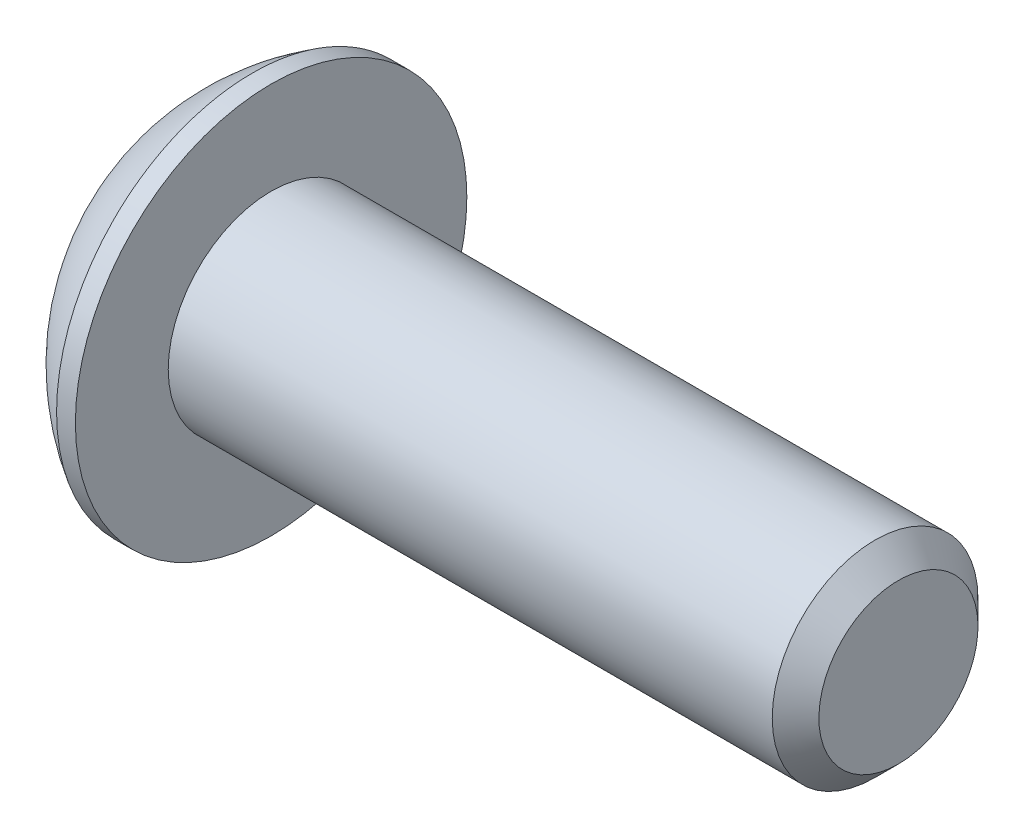
ISO-10303-21;
HEADER;
FILE_DESCRIPTION(('STEP AP214'),'2;1');
FILE_NAME('part.step','',(''),(''),'','','');
FILE_SCHEMA(('AUTOMOTIVE_DESIGN { 1 0 10303 214 1 1 1 1 }'));
ENDSEC;
DATA;
#1=APPLICATION_CONTEXT('core data for automotive mechanical design processes');
#2=APPLICATION_PROTOCOL_DEFINITION('international standard','automotive_design',2000,#1);
#3=PRODUCT_CONTEXT('',#1,'mechanical');
#4=PRODUCT('Part','Part','',(#3));
#5=PRODUCT_RELATED_PRODUCT_CATEGORY('part','',(#4));
#6=PRODUCT_DEFINITION_FORMATION('','',#4);
#7=PRODUCT_DEFINITION_CONTEXT('part definition',#1,'design');
#8=PRODUCT_DEFINITION('design','',#6,#7);
#9=PRODUCT_DEFINITION_SHAPE('','',#8);
#10=(LENGTH_UNIT() NAMED_UNIT(*) SI_UNIT(.MILLI.,.METRE.));
#11=(NAMED_UNIT(*) PLANE_ANGLE_UNIT() SI_UNIT($,.RADIAN.));
#12=(NAMED_UNIT(*) SI_UNIT($,.STERADIAN.) SOLID_ANGLE_UNIT());
#13=UNCERTAINTY_MEASURE_WITH_UNIT(LENGTH_MEASURE(1.E-05),#10,'distance_accuracy_value','');
#14=(GEOMETRIC_REPRESENTATION_CONTEXT(3) GLOBAL_UNCERTAINTY_ASSIGNED_CONTEXT((#13)) GLOBAL_UNIT_ASSIGNED_CONTEXT((#10,
#11,#12)) REPRESENTATION_CONTEXT('',''));
#15=CARTESIAN_POINT('',(0.,0.,0.));
#16=DIRECTION('',(0.,0.,1.));
#17=DIRECTION('',(1.,0.,0.));
#18=AXIS2_PLACEMENT_3D('',#15,#16,#17);
#19=CARTESIAN_POINT('',(1.32080000000034,0.,0.));
#20=DIRECTION('',(-1.,0.,0.));
#21=DIRECTION('',(0.,-1.,0.));
#22=AXIS2_PLACEMENT_3D('',#19,#20,#21);
#23=CONICAL_SURFACE('',#22,1.1937999999998,1.04719755119608);
#24=CARTESIAN_POINT('',(2.01004075135902,0.,4.44089209850063E-13));
#25=VERTEX_POINT('',#24);
#26=VERTEX_LOOP('',#25);
#27=FACE_BOUND('',#26,.T.);
#28=CARTESIAN_POINT('',(1.32080000000022,0.,0.));
#29=DIRECTION('',(-1.,0.,0.));
#30=DIRECTION('',(0.,-1.,0.));
#31=AXIS2_PLACEMENT_3D('',#28,#29,#30);
#32=CIRCLE('',#31,1.19380000000002);
#33=CARTESIAN_POINT('',(1.32080000000015,-1.03386112703791,0.596900000000036));
#34=VERTEX_POINT('',#33);
#35=CARTESIAN_POINT('',(1.32080000000015,0.,1.19380000000011));
#36=VERTEX_POINT('',#35);
#37=EDGE_CURVE('E21',#34,#36,#32,.T.);
#38=ORIENTED_EDGE('',*,*,#37,.T.);
#39=CARTESIAN_POINT('',(1.32080000000009,0.,0.));
#40=DIRECTION('',(-1.,0.,0.));
#41=DIRECTION('',(0.,-1.,0.));
#42=AXIS2_PLACEMENT_3D('',#39,#40,#41);
#43=CIRCLE('',#42,1.19380000000024);
#44=CARTESIAN_POINT('',(1.32080000000004,1.03386112703797,0.596900000000073));
#45=VERTEX_POINT('',#44);
#46=EDGE_CURVE('E149',#36,#45,#43,.T.);
#47=ORIENTED_EDGE('',*,*,#46,.T.);
#48=CARTESIAN_POINT('',(1.32080000000009,0.,0.));
#49=DIRECTION('',(-1.,0.,0.));
#50=DIRECTION('',(0.,-1.,0.));
#51=AXIS2_PLACEMENT_3D('',#48,#49,#50);
#52=CIRCLE('',#51,1.19380000000024);
#53=CARTESIAN_POINT('',(1.32080000000009,1.03386112703793,-0.596900000000125));
#54=VERTEX_POINT('',#53);
#55=EDGE_CURVE('E406',#45,#54,#52,.T.);
#56=ORIENTED_EDGE('',*,*,#55,.T.);
#57=CARTESIAN_POINT('',(1.32080000000009,0.,0.));
#58=DIRECTION('',(-1.,0.,0.));
#59=DIRECTION('',(0.,-1.,0.));
#60=AXIS2_PLACEMENT_3D('',#57,#58,#59);
#61=CIRCLE('',#60,1.19380000000024);
#62=CARTESIAN_POINT('',(1.32080000000006,0.,-1.19380000000015));
#63=VERTEX_POINT('',#62);
#64=EDGE_CURVE('E407',#54,#63,#61,.T.);
#65=ORIENTED_EDGE('',*,*,#64,.T.);
#66=CARTESIAN_POINT('',(1.32080000000009,0.,0.));
#67=DIRECTION('',(-1.,0.,0.));
#68=DIRECTION('',(0.,-1.,0.));
#69=AXIS2_PLACEMENT_3D('',#66,#67,#68);
#70=CIRCLE('',#69,1.19380000000024);
#71=CARTESIAN_POINT('',(1.32080000000009,-1.03386112703797,-0.596900000000177));
#72=VERTEX_POINT('',#71);
#73=EDGE_CURVE('E94',#63,#72,#70,.T.);
#74=ORIENTED_EDGE('',*,*,#73,.T.);
#75=CARTESIAN_POINT('',(1.32080000000009,0.,0.));
#76=DIRECTION('',(-1.,0.,0.));
#77=DIRECTION('',(0.,-1.,0.));
#78=AXIS2_PLACEMENT_3D('',#75,#76,#77);
#79=CIRCLE('',#78,1.19380000000024);
#80=EDGE_CURVE('E90',#72,#34,#79,.T.);
#81=ORIENTED_EDGE('',*,*,#80,.T.);
#82=EDGE_LOOP('',(#38,#47,#56,#65,#74,#81));
#83=FACE_BOUND('',#82,.T.);
#84=ADVANCED_FACE('F18',(#27,#83),#23,.F.);
#85=CARTESIAN_POINT('',(1.3208,-1.37848150271714,-2.22044604925031E-13));
#86=DIRECTION('',(1.,0.,0.));
#87=DIRECTION('',(0.,1.,0.));
#88=AXIS2_PLACEMENT_3D('',#85,#86,#87);
#89=PLANE('',#88);
#90=DIRECTION('',(0.,0.500000000000001,0.866025403784438));
#91=VECTOR('',#90,1.);
#92=CARTESIAN_POINT('',(1.3208,-1.37848150271714,-2.22044604925031E-13));
#93=LINE('',#92,#91);
#94=CARTESIAN_POINT('',(1.3208,-0.689240751358501,1.19379999999993));
#95=VERTEX_POINT('',#94);
#96=EDGE_CURVE('E102',#95,#34,#93,.F.);
#97=ORIENTED_EDGE('',*,*,#96,.F.);
#98=DIRECTION('',(0.,1.,0.));
#99=VECTOR('',#98,1.);
#100=CARTESIAN_POINT('',(1.3208,-0.68924075135858,1.19379999999997));
#101=LINE('',#100,#99);
#102=EDGE_CURVE('E104',#36,#95,#101,.F.);
#103=ORIENTED_EDGE('',*,*,#102,.F.);
#104=ORIENTED_EDGE('',*,*,#37,.F.);
#105=EDGE_LOOP('',(#97,#103,#104));
#106=FACE_BOUND('',#105,.T.);
#107=ADVANCED_FACE('F100',(#106),#89,.F.);
#108=CARTESIAN_POINT('',(1.3208,-1.37848150271714,-2.22044604925031E-13));
#109=DIRECTION('',(1.,0.,0.));
#110=DIRECTION('',(0.,1.,0.));
#111=AXIS2_PLACEMENT_3D('',#108,#109,#110);
#112=PLANE('',#111);
#113=DIRECTION('',(0.,-0.5,0.866025403784438));
#114=VECTOR('',#113,1.);
#115=CARTESIAN_POINT('',(1.3208,-0.68924075135858,-1.19380000000024));
#116=LINE('',#115,#114);
#117=CARTESIAN_POINT('',(1.3208,-1.37848150271716,-2.33780927942087E-13));
#118=VERTEX_POINT('',#117);
#119=EDGE_CURVE('E110',#118,#72,#116,.F.);
#120=ORIENTED_EDGE('',*,*,#119,.F.);
#121=DIRECTION('',(0.,0.500000000000001,0.866025403784438));
#122=VECTOR('',#121,1.);
#123=CARTESIAN_POINT('',(1.3208,-1.37848150271714,-2.22044604925031E-13));
#124=LINE('',#123,#122);
#125=EDGE_CURVE('E107',#34,#118,#124,.F.);
#126=ORIENTED_EDGE('',*,*,#125,.F.);
#127=ORIENTED_EDGE('',*,*,#80,.F.);
#128=EDGE_LOOP('',(#120,#126,#127));
#129=FACE_BOUND('',#128,.T.);
#130=ADVANCED_FACE('F108',(#129),#112,.F.);
#131=CARTESIAN_POINT('',(1.3208,-1.37848150271714,-2.22044604925031E-13));
#132=DIRECTION('',(1.,0.,0.));
#133=DIRECTION('',(0.,1.,0.));
#134=AXIS2_PLACEMENT_3D('',#131,#132,#133);
#135=PLANE('',#134);
#136=DIRECTION('',(0.,1.,0.));
#137=VECTOR('',#136,1.);
#138=CARTESIAN_POINT('',(1.3208,0.689240751358559,-1.19380000000019));
#139=LINE('',#138,#137);
#140=CARTESIAN_POINT('',(1.3208,-0.689240751358584,-1.1938000000002));
#141=VERTEX_POINT('',#140);
#142=EDGE_CURVE('E377',#141,#63,#139,.T.);
#143=ORIENTED_EDGE('',*,*,#142,.F.);
#144=DIRECTION('',(0.,-0.5,0.866025403784438));
#145=VECTOR('',#144,1.);
#146=CARTESIAN_POINT('',(1.3208,-0.68924075135858,-1.19380000000024));
#147=LINE('',#146,#145);
#148=EDGE_CURVE('E389',#72,#141,#147,.F.);
#149=ORIENTED_EDGE('',*,*,#148,.F.);
#150=ORIENTED_EDGE('',*,*,#73,.F.);
#151=EDGE_LOOP('',(#143,#149,#150));
#152=FACE_BOUND('',#151,.T.);
#153=ADVANCED_FACE('F192',(#152),#135,.F.);
#154=CARTESIAN_POINT('',(1.3208,-1.37848150271714,-2.22044604925031E-13));
#155=DIRECTION('',(1.,0.,0.));
#156=DIRECTION('',(0.,1.,0.));
#157=AXIS2_PLACEMENT_3D('',#154,#155,#156);
#158=PLANE('',#157);
#159=DIRECTION('',(0.,-0.5,-0.866025403784439));
#160=VECTOR('',#159,1.);
#161=CARTESIAN_POINT('',(1.3208,1.37848150271715,0.));
#162=LINE('',#161,#160);
#163=CARTESIAN_POINT('',(1.3208,0.689240751358499,-1.19380000000016));
#164=VERTEX_POINT('',#163);
#165=EDGE_CURVE('E363',#164,#54,#162,.F.);
#166=ORIENTED_EDGE('',*,*,#165,.F.);
#167=DIRECTION('',(0.,1.,0.));
#168=VECTOR('',#167,1.);
#169=CARTESIAN_POINT('',(1.3208,0.689240751358559,-1.19380000000019));
#170=LINE('',#169,#168);
#171=EDGE_CURVE('E374',#63,#164,#170,.T.);
#172=ORIENTED_EDGE('',*,*,#171,.F.);
#173=ORIENTED_EDGE('',*,*,#64,.F.);
#174=EDGE_LOOP('',(#166,#172,#173));
#175=FACE_BOUND('',#174,.T.);
#176=ADVANCED_FACE('F188',(#175),#158,.F.);
#177=CARTESIAN_POINT('',(1.3208,-1.37848150271714,-2.22044604925031E-13));
#178=DIRECTION('',(1.,0.,0.));
#179=DIRECTION('',(0.,1.,0.));
#180=AXIS2_PLACEMENT_3D('',#177,#178,#179);
#181=PLANE('',#180);
#182=DIRECTION('',(0.,0.5,-0.866025403784439));
#183=VECTOR('',#182,1.);
#184=CARTESIAN_POINT('',(1.3208,0.68924075135858,1.19380000000002));
#185=LINE('',#184,#183);
#186=CARTESIAN_POINT('',(1.3208,1.37848150271716,0.));
#187=VERTEX_POINT('',#186);
#188=EDGE_CURVE('E342',#187,#45,#185,.F.);
#189=ORIENTED_EDGE('',*,*,#188,.F.);
#190=DIRECTION('',(0.,-0.5,-0.866025403784439));
#191=VECTOR('',#190,1.);
#192=CARTESIAN_POINT('',(1.3208,1.37848150271715,0.));
#193=LINE('',#192,#191);
#194=EDGE_CURVE('E361',#54,#187,#193,.F.);
#195=ORIENTED_EDGE('',*,*,#194,.F.);
#196=ORIENTED_EDGE('',*,*,#55,.F.);
#197=EDGE_LOOP('',(#189,#195,#196));
#198=FACE_BOUND('',#197,.T.);
#199=ADVANCED_FACE('F184',(#198),#181,.F.);
#200=CARTESIAN_POINT('',(1.3208,-1.37848150271714,-2.22044604925031E-13));
#201=DIRECTION('',(1.,0.,0.));
#202=DIRECTION('',(0.,1.,0.));
#203=AXIS2_PLACEMENT_3D('',#200,#201,#202);
#204=PLANE('',#203);
#205=DIRECTION('',(0.,1.,0.));
#206=VECTOR('',#205,1.);
#207=CARTESIAN_POINT('',(1.3208,-0.68924075135858,1.19379999999997));
#208=LINE('',#207,#206);
#209=CARTESIAN_POINT('',(1.3208,0.689240751358586,1.1938));
#210=VERTEX_POINT('',#209);
#211=EDGE_CURVE('E119',#210,#36,#208,.F.);
#212=ORIENTED_EDGE('',*,*,#211,.F.);
#213=DIRECTION('',(0.,0.5,-0.866025403784439));
#214=VECTOR('',#213,1.);
#215=CARTESIAN_POINT('',(1.3208,0.68924075135858,1.19380000000002));
#216=LINE('',#215,#214);
#217=EDGE_CURVE('E345',#45,#210,#216,.F.);
#218=ORIENTED_EDGE('',*,*,#217,.F.);
#219=ORIENTED_EDGE('',*,*,#46,.F.);
#220=EDGE_LOOP('',(#212,#218,#219));
#221=FACE_BOUND('',#220,.T.);
#222=ADVANCED_FACE('F180',(#221),#204,.F.);
#223=CARTESIAN_POINT('',(1.3208,-0.68924075135858,1.19379999999997));
#224=DIRECTION('',(0.,0.,-1.));
#225=DIRECTION('',(-1.,0.,0.));
#226=AXIS2_PLACEMENT_3D('',#223,#224,#225);
#227=PLANE('',#226);
#228=DIRECTION('',(0.,-1.,0.));
#229=VECTOR('',#228,1.);
#230=CARTESIAN_POINT('',(0.,0.,1.19380000000002));
#231=LINE('',#230,#229);
#232=CARTESIAN_POINT('',(0.,0.68924075135858,1.19379999999999));
#233=VERTEX_POINT('',#232);
#234=CARTESIAN_POINT('',(0.,-0.689240751358549,1.19379999999997));
#235=VERTEX_POINT('',#234);
#236=EDGE_CURVE('E339',#233,#235,#231,.T.);
#237=ORIENTED_EDGE('',*,*,#236,.F.);
#238=DIRECTION('',(1.,0.,0.));
#239=VECTOR('',#238,1.);
#240=CARTESIAN_POINT('',(1.3208,0.68924075135858,1.19380000000002));
#241=LINE('',#240,#239);
#242=EDGE_CURVE('E351',#210,#233,#241,.F.);
#243=ORIENTED_EDGE('',*,*,#242,.F.);
#244=ORIENTED_EDGE('',*,*,#211,.T.);
#245=ORIENTED_EDGE('',*,*,#102,.T.);
#246=DIRECTION('',(1.,0.,0.));
#247=VECTOR('',#246,1.);
#248=CARTESIAN_POINT('',(1.3208,-0.689240751358485,1.19379999999991));
#249=LINE('',#248,#247);
#250=EDGE_CURVE('E113',#235,#95,#249,.T.);
#251=ORIENTED_EDGE('',*,*,#250,.F.);
#252=EDGE_LOOP('',(#237,#243,#244,#245,#251));
#253=FACE_BOUND('',#252,.T.);
#254=ADVANCED_FACE('F177',(#253),#227,.T.);
#255=CARTESIAN_POINT('',(1.3208,-1.37848150271714,-2.22044604925031E-13));
#256=DIRECTION('',(0.,0.866025403784438,-0.500000000000001));
#257=DIRECTION('',(0.,0.500000000000001,0.866025403784438));
#258=AXIS2_PLACEMENT_3D('',#255,#256,#257);
#259=PLANE('',#258);
#260=DIRECTION('',(0.,-0.499999999999932,-0.866025403784478));
#261=VECTOR('',#260,1.);
#262=CARTESIAN_POINT('',(0.,-0.68924075135858,1.19379999999997));
#263=LINE('',#262,#261);
#264=CARTESIAN_POINT('',(0.,-1.37848150271715,-2.25312539892153E-13));
#265=VERTEX_POINT('',#264);
#266=EDGE_CURVE('E336',#235,#265,#263,.T.);
#267=ORIENTED_EDGE('',*,*,#266,.F.);
#268=ORIENTED_EDGE('',*,*,#250,.T.);
#269=ORIENTED_EDGE('',*,*,#96,.T.);
#270=ORIENTED_EDGE('',*,*,#125,.T.);
#271=DIRECTION('',(1.,0.,0.));
#272=VECTOR('',#271,1.);
#273=CARTESIAN_POINT('',(1.3208,-1.37848150271716,-2.3483819056036E-13));
#274=LINE('',#273,#272);
#275=EDGE_CURVE('E386',#265,#118,#274,.T.);
#276=ORIENTED_EDGE('',*,*,#275,.F.);
#277=EDGE_LOOP('',(#267,#268,#269,#270,#276));
#278=FACE_BOUND('',#277,.T.);
#279=ADVANCED_FACE('F117',(#278),#259,.T.);
#280=CARTESIAN_POINT('',(1.3208,-0.68924075135858,-1.19380000000024));
#281=DIRECTION('',(0.,0.866025403784438,0.5));
#282=DIRECTION('',(0.,-0.5,0.866025403784438));
#283=AXIS2_PLACEMENT_3D('',#280,#281,#282);
#284=PLANE('',#283);
#285=DIRECTION('',(0.,0.499999999999984,-0.866025403784448));
#286=VECTOR('',#285,1.);
#287=CARTESIAN_POINT('',(0.,-1.37848150271714,-2.22044604925031E-13));
#288=LINE('',#287,#286);
#289=CARTESIAN_POINT('',(0.,-0.68924075135858,-1.19380000000023));
#290=VERTEX_POINT('',#289);
#291=EDGE_CURVE('E333',#265,#290,#288,.T.);
#292=ORIENTED_EDGE('',*,*,#291,.F.);
#293=ORIENTED_EDGE('',*,*,#275,.T.);
#294=ORIENTED_EDGE('',*,*,#119,.T.);
#295=ORIENTED_EDGE('',*,*,#148,.T.);
#296=DIRECTION('',(1.,0.,0.));
#297=VECTOR('',#296,1.);
#298=CARTESIAN_POINT('',(1.3208,-0.68924075135858,-1.19380000000019));
#299=LINE('',#298,#297);
#300=EDGE_CURVE('E371',#290,#141,#299,.T.);
#301=ORIENTED_EDGE('',*,*,#300,.F.);
#302=EDGE_LOOP('',(#292,#293,#294,#295,#301));
#303=FACE_BOUND('',#302,.T.);
#304=ADVANCED_FACE('F170',(#303),#284,.T.);
#305=CARTESIAN_POINT('',(1.3208,0.689240751358559,-1.19380000000019));
#306=DIRECTION('',(0.,0.,1.));
#307=DIRECTION('',(1.,0.,0.));
#308=AXIS2_PLACEMENT_3D('',#305,#306,#307);
#309=PLANE('',#308);
#310=DIRECTION('',(0.,-1.,0.));
#311=VECTOR('',#310,1.);
#312=CARTESIAN_POINT('',(0.,0.,-1.19380000000024));
#313=LINE('',#312,#311);
#314=CARTESIAN_POINT('',(0.,0.689240751358533,-1.19380000000019));
#315=VERTEX_POINT('',#314);
#316=EDGE_CURVE('E330',#290,#315,#313,.F.);
#317=ORIENTED_EDGE('',*,*,#316,.F.);
#318=ORIENTED_EDGE('',*,*,#300,.T.);
#319=ORIENTED_EDGE('',*,*,#142,.T.);
#320=ORIENTED_EDGE('',*,*,#171,.T.);
#321=DIRECTION('',(1.,0.,0.));
#322=VECTOR('',#321,1.);
#323=CARTESIAN_POINT('',(1.3208,0.689240751358487,-1.19380000000015));
#324=LINE('',#323,#322);
#325=EDGE_CURVE('E346',#315,#164,#324,.T.);
#326=ORIENTED_EDGE('',*,*,#325,.F.);
#327=EDGE_LOOP('',(#317,#318,#319,#320,#326));
#328=FACE_BOUND('',#327,.T.);
#329=ADVANCED_FACE('F167',(#328),#309,.T.);
#330=CARTESIAN_POINT('',(1.3208,1.37848150271715,0.));
#331=DIRECTION('',(0.,-0.866025403784439,0.5));
#332=DIRECTION('',(0.,-0.5,-0.866025403784439));
#333=AXIS2_PLACEMENT_3D('',#330,#331,#332);
#334=PLANE('',#333);
#335=DIRECTION('',(0.,0.499999999999947,0.866025403784469));
#336=VECTOR('',#335,1.);
#337=CARTESIAN_POINT('',(0.,0.689240751358559,-1.19380000000019));
#338=LINE('',#337,#336);
#339=CARTESIAN_POINT('',(0.,1.37848150271715,0.));
#340=VERTEX_POINT('',#339);
#341=EDGE_CURVE('E327',#315,#340,#338,.T.);
#342=ORIENTED_EDGE('',*,*,#341,.F.);
#343=ORIENTED_EDGE('',*,*,#325,.T.);
#344=ORIENTED_EDGE('',*,*,#165,.T.);
#345=ORIENTED_EDGE('',*,*,#194,.T.);
#346=DIRECTION('',(1.,0.,0.));
#347=VECTOR('',#346,1.);
#348=CARTESIAN_POINT('',(1.3208,1.37848150271716,0.));
#349=LINE('',#348,#347);
#350=EDGE_CURVE('E36',#340,#187,#349,.T.);
#351=ORIENTED_EDGE('',*,*,#350,.F.);
#352=EDGE_LOOP('',(#342,#343,#344,#345,#351));
#353=FACE_BOUND('',#352,.T.);
#354=ADVANCED_FACE('F163',(#353),#334,.T.);
#355=CARTESIAN_POINT('',(1.3208,0.68924075135858,1.19380000000002));
#356=DIRECTION('',(0.,-0.866025403784439,-0.5));
#357=DIRECTION('',(0.,0.5,-0.866025403784439));
#358=AXIS2_PLACEMENT_3D('',#355,#356,#357);
#359=PLANE('',#358);
#360=DIRECTION('',(0.,-0.499999999999988,0.866025403784446));
#361=VECTOR('',#360,1.);
#362=CARTESIAN_POINT('',(0.,1.37848150271715,0.));
#363=LINE('',#362,#361);
#364=EDGE_CURVE('E148',#340,#233,#363,.T.);
#365=ORIENTED_EDGE('',*,*,#364,.F.);
#366=ORIENTED_EDGE('',*,*,#350,.T.);
#367=ORIENTED_EDGE('',*,*,#188,.T.);
#368=ORIENTED_EDGE('',*,*,#217,.T.);
#369=ORIENTED_EDGE('',*,*,#242,.T.);
#370=EDGE_LOOP('',(#365,#366,#367,#368,#369));
#371=FACE_BOUND('',#370,.T.);
#372=ADVANCED_FACE('F159',(#371),#359,.T.);
#373=CARTESIAN_POINT('',(0.,0.,0.));
#374=DIRECTION('',(-1.,0.,0.));
#375=DIRECTION('',(0.,-1.,0.));
#376=AXIS2_PLACEMENT_3D('',#373,#374,#375);
#377=PLANE('',#376);
#378=ORIENTED_EDGE('',*,*,#341,.T.);
#379=ORIENTED_EDGE('',*,*,#364,.T.);
#380=ORIENTED_EDGE('',*,*,#236,.T.);
#381=ORIENTED_EDGE('',*,*,#266,.T.);
#382=ORIENTED_EDGE('',*,*,#291,.T.);
#383=ORIENTED_EDGE('',*,*,#316,.T.);
#384=EDGE_LOOP('',(#378,#379,#380,#381,#382,#383));
#385=FACE_BOUND('',#384,.T.);
#386=CARTESIAN_POINT('',(0.,1.9812,0.));
#387=CARTESIAN_POINT('',(0.,1.9811996664299,0.0556258831179428));
#388=CARTESIAN_POINT('',(0.,1.97885520380442,0.111261989398606));
#389=CARTESIAN_POINT('',(0.,1.96949260169541,0.222149719830458));
#390=CARTESIAN_POINT('',(0.,1.96247308239605,0.277401225602895));
#391=CARTESIAN_POINT('',(0.,1.94379192841038,0.387209508139748));
#392=CARTESIAN_POINT('',(-1.86048374172952E-13,1.93212292489526,0.441765039546366));
#393=CARTESIAN_POINT('',(1.85832442250416E-13,1.90422331175315,0.549729449347493));
#394=CARTESIAN_POINT('',(6.94429009922E-13,1.88798900035338,0.60313735920887));
#395=CARTESIAN_POINT('',(1.15526853418273E-12,1.832662144765,0.760839131321829));
#396=CARTESIAN_POINT('',(0.,1.78690023648845,0.862876433575429));
#397=CARTESIAN_POINT('',(0.,1.67887358150667,1.05780719540872));
#398=CARTESIAN_POINT('',(9.54457529854624E-13,1.6166082074585,1.15070030720801));
#399=CARTESIAN_POINT('',(5.94692742469012E-13,1.51224157140982,1.28116890915698));
#400=CARTESIAN_POINT('',(1.62702719378681E-13,1.47559703943539,1.32320451127027));
#401=CARTESIAN_POINT('',(-1.62841563858173E-13,1.39893832619713,1.40400288695709));
#402=CARTESIAN_POINT('',(0.,1.35892742784698,1.44276877695455));
#403=CARTESIAN_POINT('',(1.13378689260782E-13,1.23416504602197,1.55382272417904));
#404=CARTESIAN_POINT('',(0.,1.14466125559859,1.62089527952111));
#405=CARTESIAN_POINT('',(0.,0.955712144178159,1.7390221808118));
#406=CARTESIAN_POINT('',(0.,0.856267198233558,1.79007713076008));
#407=CARTESIAN_POINT('',(0.,0.650206345910838,1.87477637530954));
#408=CARTESIAN_POINT('',(0.,0.54359051613485,1.90842085586267));
#409=CARTESIAN_POINT('',(0.,0.326226155292012,1.95733039300657));
#410=CARTESIAN_POINT('',(0.,0.215477602157924,1.97259535144288));
#411=CARTESIAN_POINT('',(0.,-0.00701040587545303,1.98431697865418));
#412=CARTESIAN_POINT('',(0.,-0.118749860774741,1.98077364742917));
#413=CARTESIAN_POINT('',(0.,-0.340050178355492,1.95497485623825));
#414=CARTESIAN_POINT('',(0.,-0.449611052668263,1.93271949620218));
#415=CARTESIAN_POINT('',(0.,-0.663431110729182,1.87014138774524));
#416=CARTESIAN_POINT('',(0.,-0.767690237838528,1.82981844635272));
#417=CARTESIAN_POINT('',(0.,-0.968005760719354,1.73219968377097));
#418=CARTESIAN_POINT('',(0.,-1.06406184698111,1.6749032225164));
#419=CARTESIAN_POINT('',(0.,-1.19980276751284,1.57757371205874));
#420=CARTESIAN_POINT('',(0.,-1.24366557129214,1.54322665019466));
#421=CARTESIAN_POINT('',(0.,-1.32838995706697,1.47093063174264));
#422=CARTESIAN_POINT('',(0.,-1.36924860178707,1.4329782310244));
#423=CARTESIAN_POINT('',(0.,-1.48674671849224,1.31419842051173));
#424=CARTESIAN_POINT('',(0.,-1.55842832343238,1.22836221289311));
#425=CARTESIAN_POINT('',(0.,-1.68633968564751,1.04586168272493));
#426=CARTESIAN_POINT('',(0.,-1.74257003024881,0.949197771949775));
#427=CARTESIAN_POINT('',(0.,-1.81416142504011,0.798182600298685));
#428=CARTESIAN_POINT('',(0.,-1.83591780585876,0.746776203847792));
#429=CARTESIAN_POINT('',(0.,-1.87500754181093,0.642341081688637));
#430=CARTESIAN_POINT('',(0.,-1.89234447645405,0.589313708122847));
#431=CARTESIAN_POINT('',(0.,-1.92246053433556,0.482076273028395));
#432=CARTESIAN_POINT('',(0.,-1.93524685475119,0.427868224257511));
#433=CARTESIAN_POINT('',(0.,-1.95620937250495,0.318578151844612));
#434=CARTESIAN_POINT('',(0.,-1.96438692958148,0.263496390912872));
#435=CARTESIAN_POINT('',(0.,-1.97388528284654,0.173607715038558));
#436=CARTESIAN_POINT('',(0.,-1.97662743364427,0.138944718024998));
#437=CARTESIAN_POINT('',(0.,-1.98028489645284,0.0695224782567005));
#438=CARTESIAN_POINT('',(0.,-1.98120020846368,0.0347632355019633));
#439=CARTESIAN_POINT('',(0.,-1.98119966642991,-0.0556258831179438));
#440=CARTESIAN_POINT('',(0.,-1.97885520380443,-0.111261989398607));
#441=CARTESIAN_POINT('',(0.,-1.96949260169542,-0.222149719830459));
#442=CARTESIAN_POINT('',(0.,-1.96247308239607,-0.277401225602897));
#443=CARTESIAN_POINT('',(0.,-1.9437919284104,-0.387209508139749));
#444=CARTESIAN_POINT('',(-1.85980458939401E-13,-1.93212292489527,-0.441765039546366));
#445=CARTESIAN_POINT('',(1.86498923999874E-13,-1.90422331175316,-0.549729449347494));
#446=CARTESIAN_POINT('',(6.95860947822538E-13,-1.8879890003534,-0.603137359208871));
#447=CARTESIAN_POINT('',(1.15756617904245E-12,-1.83266214476502,-0.76083913132183));
#448=CARTESIAN_POINT('',(0.,-1.78690023648846,-0.86287643357543));
#449=CARTESIAN_POINT('',(0.,-1.67887358150668,-1.05780719540872));
#450=CARTESIAN_POINT('',(9.54213915303167E-13,-1.61660820745851,-1.15070030720801));
#451=CARTESIAN_POINT('',(5.94775746895761E-13,-1.51224157140983,-1.28116890915698));
#452=CARTESIAN_POINT('',(1.62936875990031E-13,-1.47559703943541,-1.32320451127027));
#453=CARTESIAN_POINT('',(-1.62484065894274E-13,-1.39893832619714,-1.40400288695709));
#454=CARTESIAN_POINT('',(0.,-1.358927427847,-1.44276877695455));
#455=CARTESIAN_POINT('',(1.135469922555E-13,-1.23416504602198,-1.55382272417904));
#456=CARTESIAN_POINT('',(0.,-1.1446612555986,-1.62089527952111));
#457=CARTESIAN_POINT('',(0.,-0.955712144178173,-1.7390221808118));
#458=CARTESIAN_POINT('',(0.,-0.856267198233571,-1.79007713076007));
#459=CARTESIAN_POINT('',(0.,-0.650206345910851,-1.87477637530954));
#460=CARTESIAN_POINT('',(0.,-0.543590516134863,-1.90842085586267));
#461=CARTESIAN_POINT('',(0.,-0.326226155292027,-1.95733039300657));
#462=CARTESIAN_POINT('',(0.,-0.215477602157938,-1.97259535144288));
#463=CARTESIAN_POINT('',(0.,0.00701040587543941,-1.98431697865418));
#464=CARTESIAN_POINT('',(0.,0.118749860774727,-1.98077364742917));
#465=CARTESIAN_POINT('',(0.,0.340050178355479,-1.95497485623825));
#466=CARTESIAN_POINT('',(0.,0.44961105266825,-1.93271949620218));
#467=CARTESIAN_POINT('',(0.,0.663431110729169,-1.87014138774524));
#468=CARTESIAN_POINT('',(0.,0.767690237838515,-1.82981844635272));
#469=CARTESIAN_POINT('',(0.,0.968005760719341,-1.73219968377097));
#470=CARTESIAN_POINT('',(0.,1.06406184698109,-1.6749032225164));
#471=CARTESIAN_POINT('',(0.,1.19980276751283,-1.57757371205873));
#472=CARTESIAN_POINT('',(0.,1.24366557129213,-1.54322665019466));
#473=CARTESIAN_POINT('',(0.,1.32838995706695,-1.47093063174264));
#474=CARTESIAN_POINT('',(0.,1.36924860178706,-1.4329782310244));
#475=CARTESIAN_POINT('',(0.,1.48674671849222,-1.31419842051173));
#476=CARTESIAN_POINT('',(0.,1.55842832343237,-1.22836221289311));
#477=CARTESIAN_POINT('',(0.,1.68633968564749,-1.04586168272493));
#478=CARTESIAN_POINT('',(0.,1.74257003024879,-0.949197771949773));
#479=CARTESIAN_POINT('',(0.,1.8141614250401,-0.798182600298683));
#480=CARTESIAN_POINT('',(0.,1.83591780585874,-0.74677620384779));
#481=CARTESIAN_POINT('',(0.,1.87500754181092,-0.642341081688635));
#482=CARTESIAN_POINT('',(0.,1.89234447645404,-0.589313708122846));
#483=CARTESIAN_POINT('',(0.,1.92246053433554,-0.482076273028394));
#484=CARTESIAN_POINT('',(0.,1.93524685475117,-0.427868224257509));
#485=CARTESIAN_POINT('',(0.,1.95620937250493,-0.31857815184461));
#486=CARTESIAN_POINT('',(0.,1.96438692958147,-0.263496390912871));
#487=CARTESIAN_POINT('',(0.,1.97388528284653,-0.173607715038558));
#488=CARTESIAN_POINT('',(0.,1.97662743364426,-0.138944718024998));
#489=CARTESIAN_POINT('',(0.,1.98028489645283,-0.0695224782567006));
#490=CARTESIAN_POINT('',(0.,1.98120020846367,-0.0347632355019638));
#491=CARTESIAN_POINT('',(0.,1.9812,0.));
#492=B_SPLINE_CURVE_WITH_KNOTS('',3,(#386,#387,#388,#389,#390,#391,#392,#393,#394,#395,#396,
#397,#398,#399,#400,#401,#402,#403,#404,#405,#406,#407,#408,#409,#410,#411,#412,#413,#414,#415,
#416,#417,#418,#419,#420,#421,#422,#423,#424,#425,#426,#427,#428,#429,#430,#431,#432,#433,#434,
#435,#436,#437,#438,#439,#440,#441,#442,#443,#444,#445,#446,#447,#448,#449,#450,#451,#452,#453,
#454,#455,#456,#457,#458,#459,#460,#461,#462,#463,#464,#465,#466,#467,#468,#469,#470,#471,#472,
#473,#474,#475,#476,#477,#478,#479,#480,#481,#482,#483,#484,#485,#486,#487,#488,#489,#490,#491),
.UNSPECIFIED.,.T.,.F.,(4,2,2,2,2,2,2,2,2,2,2,2,2,2,2,2,2,2,2,2,2,2,2,2,2,2,2,2,2,2,2,2,2,2,2,2,
2,2,2,2,2,2,2,2,2,2,2,2,2,2,2,2,4),(0.,0.166845646007828,0.333740557374255,0.500901034367694,
0.668197445942387,1.00199278686282,1.33580081809885,1.50292354032982,1.6698851310853,
2.00370118900129,2.33750465770544,2.6713045611591,3.00510624723801,3.33890793331697,
3.67270783677066,4.00651130547477,4.34032736339027,4.50728895414555,4.67441167637633,
5.0082197076126,5.34201504853333,5.50931146010828,5.67647193710193,5.84336684846845,
6.01021249447642,6.11448220058335,6.2187519066903,6.38559755269813,6.55249246406456,
6.719652941058,6.88694935263269,7.22074469355312,7.55455272478916,7.72167544702012,
7.8886370377756,8.2224530956916,8.55625656439575,8.8900564678494,9.22385815392831,
9.55765984000727,9.89145974346096,10.2252632121651,10.5590792700806,10.7260408608359,
10.8931635830666,11.2269716143029,11.5607669552236,11.7280633667986,11.8952238437922,
12.0621187551588,12.2289644011667,12.3332341072737,12.4375038133806),.UNSPECIFIED.);
#493=CARTESIAN_POINT('',(0.,1.9812,0.));
#494=VERTEX_POINT('',#493);
#495=EDGE_CURVE('E141',#494,#494,#492,.T.);
#496=ORIENTED_EDGE('',*,*,#495,.F.);
#497=EDGE_LOOP('',(#496));
#498=FACE_BOUND('',#497,.T.);
#499=ADVANCED_FACE('F155',(#385,#498),#377,.T.);
#500=CARTESIAN_POINT('',(4.13385000000001,0.,0.));
#501=DIRECTION('',(0.,1.,0.));
#502=DIRECTION('',(1.,0.,0.));
#503=AXIS2_PLACEMENT_3D('',#500,#501,#502);
#504=SPHERICAL_SURFACE('',#503,4.5840887057844);
#505=CARTESIAN_POINT('',(1.82880000000001,0.,0.));
#506=DIRECTION('',(-1.,0.,0.));
#507=DIRECTION('',(0.,-1.,0.));
#508=AXIS2_PLACEMENT_3D('',#505,#506,#507);
#509=CIRCLE('',#508,3.9624);
#510=CARTESIAN_POINT('',(1.82880000000001,-3.9624,0.));
#511=VERTEX_POINT('',#510);
#512=EDGE_CURVE('E138',#511,#511,#509,.F.);
#513=ORIENTED_EDGE('',*,*,#512,.F.);
#514=EDGE_LOOP('',(#513));
#515=FACE_BOUND('',#514,.T.);
#516=ORIENTED_EDGE('',*,*,#495,.T.);
#517=EDGE_LOOP('',(#516));
#518=FACE_BOUND('',#517,.T.);
#519=ADVANCED_FACE('F151',(#515,#518),#504,.T.);
#520=CARTESIAN_POINT('',(14.9098,0.,0.));
#521=DIRECTION('',(-1.,0.,0.));
#522=DIRECTION('',(0.,-1.,0.));
#523=AXIS2_PLACEMENT_3D('',#520,#521,#522);
#524=PLANE('',#523);
#525=CARTESIAN_POINT('',(14.9097999999981,0.,0.));
#526=DIRECTION('',(-1.,0.,0.));
#527=DIRECTION('',(0.,-1.,0.));
#528=AXIS2_PLACEMENT_3D('',#525,#526,#527);
#529=CIRCLE('',#528,1.61036000002923);
#530=CARTESIAN_POINT('',(14.9097999999981,-1.61036000002923,0.));
#531=VERTEX_POINT('',#530);
#532=EDGE_CURVE('E135',#531,#531,#529,.T.);
#533=ORIENTED_EDGE('',*,*,#532,.F.);
#534=EDGE_LOOP('',(#533));
#535=FACE_BOUND('',#534,.T.);
#536=ADVANCED_FACE('F222',(#535),#524,.F.);
#537=CARTESIAN_POINT('',(0.,0.,0.));
#538=DIRECTION('',(-1.,0.,0.));
#539=DIRECTION('',(0.,-1.,0.));
#540=AXIS2_PLACEMENT_3D('',#537,#538,#539);
#541=CYLINDRICAL_SURFACE('',#540,3.9624);
#542=ORIENTED_EDGE('',*,*,#512,.T.);
#543=EDGE_LOOP('',(#542));
#544=FACE_BOUND('',#543,.T.);
#545=CARTESIAN_POINT('',(2.2098,0.,0.));
#546=DIRECTION('',(-1.,0.,0.));
#547=DIRECTION('',(0.,-1.,0.));
#548=AXIS2_PLACEMENT_3D('',#545,#546,#547);
#549=CIRCLE('',#548,3.9624);
#550=CARTESIAN_POINT('',(2.2098,-3.9624,0.));
#551=VERTEX_POINT('',#550);
#552=EDGE_CURVE('E132',#551,#551,#549,.T.);
#553=ORIENTED_EDGE('',*,*,#552,.T.);
#554=EDGE_LOOP('',(#553));
#555=FACE_BOUND('',#554,.T.);
#556=ADVANCED_FACE('F219',(#544,#555),#541,.T.);
#557=CARTESIAN_POINT('',(14.4373600001018,0.,0.));
#558=DIRECTION('',(-1.,0.,0.));
#559=DIRECTION('',(0.,-1.,0.));
#560=AXIS2_PLACEMENT_3D('',#557,#558,#559);
#561=CONICAL_SURFACE('',#560,2.08279999992556,0.785398163397448);
#562=CARTESIAN_POINT('',(14.43736,0.,0.));
#563=DIRECTION('',(-1.,0.,0.));
#564=DIRECTION('',(0.,-1.,0.));
#565=AXIS2_PLACEMENT_3D('',#562,#563,#564);
#566=CIRCLE('',#565,2.0828);
#567=CARTESIAN_POINT('',(14.43736,-2.0828,0.));
#568=VERTEX_POINT('',#567);
#569=EDGE_CURVE('E27',#568,#568,#566,.T.);
#570=ORIENTED_EDGE('',*,*,#569,.F.);
#571=EDGE_LOOP('',(#570));
#572=FACE_BOUND('',#571,.T.);
#573=ORIENTED_EDGE('',*,*,#532,.T.);
#574=EDGE_LOOP('',(#573));
#575=FACE_BOUND('',#574,.T.);
#576=ADVANCED_FACE('F212',(#572,#575),#561,.T.);
#577=CARTESIAN_POINT('',(2.2098,2.08280000000001,-1.66533453693773E-13));
#578=DIRECTION('',(-1.,0.,0.));
#579=DIRECTION('',(0.,-1.,0.));
#580=AXIS2_PLACEMENT_3D('',#577,#578,#579);
#581=PLANE('',#580);
#582=CARTESIAN_POINT('',(2.2098,0.,0.));
#583=DIRECTION('',(-1.,0.,0.));
#584=DIRECTION('',(0.,-1.,0.));
#585=AXIS2_PLACEMENT_3D('',#582,#583,#584);
#586=CIRCLE('',#585,2.0828);
#587=CARTESIAN_POINT('',(2.2098,-2.0828,0.));
#588=VERTEX_POINT('',#587);
#589=EDGE_CURVE('E11',#588,#588,#586,.F.);
#590=ORIENTED_EDGE('',*,*,#589,.F.);
#591=EDGE_LOOP('',(#590));
#592=FACE_BOUND('',#591,.T.);
#593=ORIENTED_EDGE('',*,*,#552,.F.);
#594=EDGE_LOOP('',(#593));
#595=FACE_BOUND('',#594,.T.);
#596=ADVANCED_FACE('F206',(#592,#595),#581,.F.);
#597=CARTESIAN_POINT('',(0.,0.,0.));
#598=DIRECTION('',(-1.,0.,0.));
#599=DIRECTION('',(0.,-1.,0.));
#600=AXIS2_PLACEMENT_3D('',#597,#598,#599);
#601=CYLINDRICAL_SURFACE('',#600,2.0828);
#602=ORIENTED_EDGE('',*,*,#589,.T.);
#603=EDGE_LOOP('',(#602));
#604=FACE_BOUND('',#603,.T.);
#605=ORIENTED_EDGE('',*,*,#569,.T.);
#606=EDGE_LOOP('',(#605));
#607=FACE_BOUND('',#606,.T.);
#608=ADVANCED_FACE('F204',(#604,#607),#601,.T.);
#609=CLOSED_SHELL('',(#84,#107,#130,#153,#176,#199,#222,#254,#279,#304,#329,#354,#372,#499,#519,
#536,#556,#576,#596,#608));
#610=MANIFOLD_SOLID_BREP('B1',#609);
#611=ADVANCED_BREP_SHAPE_REPRESENTATION('',(#18,#610),#14);
#612=SHAPE_DEFINITION_REPRESENTATION(#9,#611);
ENDSEC;
END-ISO-10303-21;
